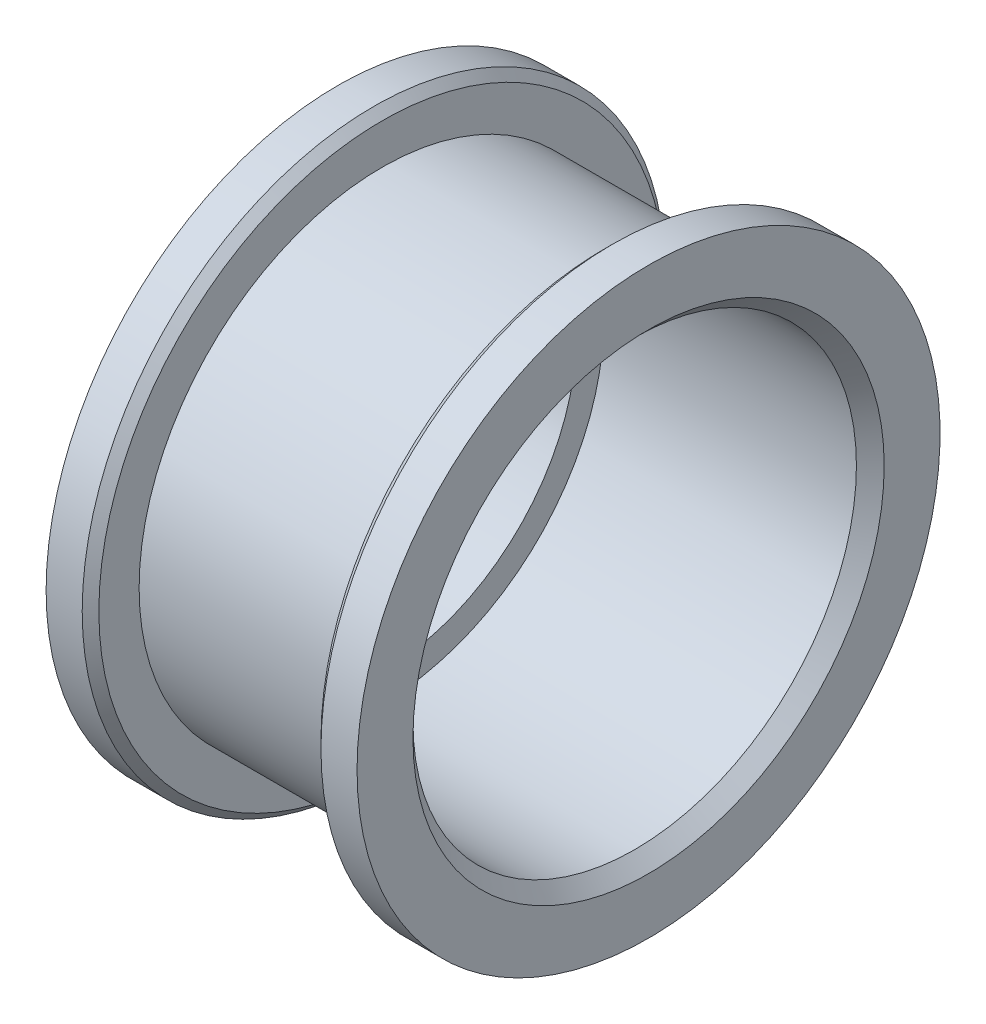
ISO-10303-21;
HEADER;
FILE_DESCRIPTION(('STEP AP214'),'2;1');
FILE_NAME('part.step','',(''),(''),'','','');
FILE_SCHEMA(('AUTOMOTIVE_DESIGN { 1 0 10303 214 1 1 1 1 }'));
ENDSEC;
DATA;
#1=APPLICATION_CONTEXT('core data for automotive mechanical design processes');
#2=APPLICATION_PROTOCOL_DEFINITION('international standard','automotive_design',2000,#1);
#3=PRODUCT_CONTEXT('',#1,'mechanical');
#4=PRODUCT('Part','Part','',(#3));
#5=PRODUCT_RELATED_PRODUCT_CATEGORY('part','',(#4));
#6=PRODUCT_DEFINITION_FORMATION('','',#4);
#7=PRODUCT_DEFINITION_CONTEXT('part definition',#1,'design');
#8=PRODUCT_DEFINITION('design','',#6,#7);
#9=PRODUCT_DEFINITION_SHAPE('','',#8);
#10=(LENGTH_UNIT() NAMED_UNIT(*) SI_UNIT(.MILLI.,.METRE.));
#11=(NAMED_UNIT(*) PLANE_ANGLE_UNIT() SI_UNIT($,.RADIAN.));
#12=(NAMED_UNIT(*) SI_UNIT($,.STERADIAN.) SOLID_ANGLE_UNIT());
#13=UNCERTAINTY_MEASURE_WITH_UNIT(LENGTH_MEASURE(1.E-05),#10,'distance_accuracy_value','');
#14=(GEOMETRIC_REPRESENTATION_CONTEXT(3) GLOBAL_UNCERTAINTY_ASSIGNED_CONTEXT((#13)) GLOBAL_UNIT_ASSIGNED_CONTEXT((#10,
#11,#12)) REPRESENTATION_CONTEXT('',''));
#15=CARTESIAN_POINT('',(0.,0.,0.));
#16=DIRECTION('',(0.,0.,1.));
#17=DIRECTION('',(1.,0.,0.));
#18=AXIS2_PLACEMENT_3D('',#15,#16,#17);
#19=CARTESIAN_POINT('',(6.16,0.,0.));
#20=DIRECTION('',(-1.,0.,0.));
#21=DIRECTION('',(0.,0.,1.));
#22=AXIS2_PLACEMENT_3D('',#19,#20,#21);
#23=CYLINDRICAL_SURFACE('',#22,8.75);
#24=CARTESIAN_POINT('',(4.,0.,0.));
#25=DIRECTION('',(-1.,0.,0.));
#26=DIRECTION('',(0.,0.,1.));
#27=AXIS2_PLACEMENT_3D('',#24,#25,#26);
#28=CIRCLE('',#27,8.75);
#29=CARTESIAN_POINT('',(4.,0.,8.75));
#30=VERTEX_POINT('',#29);
#31=EDGE_CURVE('E64',#30,#30,#28,.F.);
#32=ORIENTED_EDGE('',*,*,#31,.F.);
#33=EDGE_LOOP('',(#32));
#34=FACE_BOUND('',#33,.T.);
#35=CARTESIAN_POINT('',(-4.,0.,0.));
#36=DIRECTION('',(-1.,0.,0.));
#37=DIRECTION('',(0.,0.,1.));
#38=AXIS2_PLACEMENT_3D('',#35,#36,#37);
#39=CIRCLE('',#38,8.75);
#40=CARTESIAN_POINT('',(-4.,0.,8.75));
#41=VERTEX_POINT('',#40);
#42=EDGE_CURVE('E18',#41,#41,#39,.F.);
#43=ORIENTED_EDGE('',*,*,#42,.T.);
#44=EDGE_LOOP('',(#43));
#45=FACE_BOUND('',#44,.T.);
#46=ADVANCED_FACE('F15',(#34,#45),#23,.T.);
#47=CARTESIAN_POINT('',(-4.,0.,0.));
#48=DIRECTION('',(-1.,0.,0.));
#49=DIRECTION('',(0.,0.,1.));
#50=AXIS2_PLACEMENT_3D('',#47,#48,#49);
#51=PLANE('',#50);
#52=ORIENTED_EDGE('',*,*,#42,.F.);
#53=EDGE_LOOP('',(#52));
#54=FACE_BOUND('',#53,.T.);
#55=CARTESIAN_POINT('',(-3.99999999999998,0.,0.));
#56=DIRECTION('',(-1.,0.,0.));
#57=DIRECTION('',(0.,0.,1.));
#58=AXIS2_PLACEMENT_3D('',#55,#56,#57);
#59=CIRCLE('',#58,10.2);
#60=CARTESIAN_POINT('',(-3.99999999999998,0.,10.2));
#61=VERTEX_POINT('',#60);
#62=EDGE_CURVE('E61',#61,#61,#59,.T.);
#63=ORIENTED_EDGE('',*,*,#62,.F.);
#64=EDGE_LOOP('',(#63));
#65=FACE_BOUND('',#64,.T.);
#66=ADVANCED_FACE('F73',(#54,#65),#51,.F.);
#67=CARTESIAN_POINT('',(4.,0.,0.));
#68=DIRECTION('',(-1.,0.,0.));
#69=DIRECTION('',(0.,0.,1.));
#70=AXIS2_PLACEMENT_3D('',#67,#68,#69);
#71=PLANE('',#70);
#72=ORIENTED_EDGE('',*,*,#31,.T.);
#73=EDGE_LOOP('',(#72));
#74=FACE_BOUND('',#73,.T.);
#75=CARTESIAN_POINT('',(4.00000000000197,0.,0.));
#76=DIRECTION('',(1.,0.,0.));
#77=DIRECTION('',(0.,0.,-1.));
#78=AXIS2_PLACEMENT_3D('',#75,#76,#77);
#79=CIRCLE('',#78,10.199999999998);
#80=CARTESIAN_POINT('',(4.00000000000197,0.,-10.199999999998));
#81=VERTEX_POINT('',#80);
#82=EDGE_CURVE('E57',#81,#81,#79,.T.);
#83=ORIENTED_EDGE('',*,*,#82,.F.);
#84=EDGE_LOOP('',(#83));
#85=FACE_BOUND('',#84,.T.);
#86=ADVANCED_FACE('F76',(#74,#85),#71,.T.);
#87=CARTESIAN_POINT('',(-4.30000000000002,0.,0.));
#88=DIRECTION('',(-1.,0.,0.));
#89=DIRECTION('',(0.,0.,1.));
#90=AXIS2_PLACEMENT_3D('',#87,#88,#89);
#91=CONICAL_SURFACE('',#90,10.5,0.785398163397298);
#92=ORIENTED_EDGE('',*,*,#62,.T.);
#93=EDGE_LOOP('',(#92));
#94=FACE_BOUND('',#93,.T.);
#95=CARTESIAN_POINT('',(-4.3,0.,0.));
#96=DIRECTION('',(-1.,0.,0.));
#97=DIRECTION('',(0.,0.,1.));
#98=AXIS2_PLACEMENT_3D('',#95,#96,#97);
#99=CIRCLE('',#98,10.5);
#100=CARTESIAN_POINT('',(-4.3,0.,10.5));
#101=VERTEX_POINT('',#100);
#102=EDGE_CURVE('E36',#101,#101,#99,.T.);
#103=ORIENTED_EDGE('',*,*,#102,.F.);
#104=EDGE_LOOP('',(#103));
#105=FACE_BOUND('',#104,.T.);
#106=ADVANCED_FACE('F79',(#94,#105),#91,.T.);
#107=CARTESIAN_POINT('',(4.30000000000203,0.,0.));
#108=DIRECTION('',(1.,0.,0.));
#109=DIRECTION('',(0.,0.,-1.));
#110=AXIS2_PLACEMENT_3D('',#107,#108,#109);
#111=CONICAL_SURFACE('',#110,10.499999999998,0.785398163397299);
#112=CARTESIAN_POINT('',(4.3,0.,0.));
#113=DIRECTION('',(-1.,0.,0.));
#114=DIRECTION('',(0.,0.,1.));
#115=AXIS2_PLACEMENT_3D('',#112,#113,#114);
#116=CIRCLE('',#115,10.5);
#117=CARTESIAN_POINT('',(4.3,0.,10.5));
#118=VERTEX_POINT('',#117);
#119=EDGE_CURVE('E56',#118,#118,#116,.F.);
#120=ORIENTED_EDGE('',*,*,#119,.F.);
#121=EDGE_LOOP('',(#120));
#122=FACE_BOUND('',#121,.T.);
#123=ORIENTED_EDGE('',*,*,#82,.T.);
#124=EDGE_LOOP('',(#123));
#125=FACE_BOUND('',#124,.T.);
#126=ADVANCED_FACE('F82',(#122,#125),#111,.T.);
#127=CARTESIAN_POINT('',(6.16,0.,0.));
#128=DIRECTION('',(-1.,0.,0.));
#129=DIRECTION('',(0.,0.,1.));
#130=AXIS2_PLACEMENT_3D('',#127,#128,#129);
#131=CYLINDRICAL_SURFACE('',#130,10.5);
#132=CARTESIAN_POINT('',(-5.6,0.,0.));
#133=DIRECTION('',(-1.,0.,0.));
#134=DIRECTION('',(0.,0.,1.));
#135=AXIS2_PLACEMENT_3D('',#132,#133,#134);
#136=CIRCLE('',#135,10.5);
#137=CARTESIAN_POINT('',(-5.6,0.,10.5));
#138=VERTEX_POINT('',#137);
#139=EDGE_CURVE('E52',#138,#138,#136,.T.);
#140=ORIENTED_EDGE('',*,*,#139,.F.);
#141=EDGE_LOOP('',(#140));
#142=FACE_BOUND('',#141,.T.);
#143=ORIENTED_EDGE('',*,*,#102,.T.);
#144=EDGE_LOOP('',(#143));
#145=FACE_BOUND('',#144,.T.);
#146=ADVANCED_FACE('F96',(#142,#145),#131,.T.);
#147=CARTESIAN_POINT('',(6.16,0.,0.));
#148=DIRECTION('',(-1.,0.,0.));
#149=DIRECTION('',(0.,0.,1.));
#150=AXIS2_PLACEMENT_3D('',#147,#148,#149);
#151=CYLINDRICAL_SURFACE('',#150,10.5);
#152=CARTESIAN_POINT('',(5.6,0.,0.));
#153=DIRECTION('',(-1.,0.,0.));
#154=DIRECTION('',(0.,0.,1.));
#155=AXIS2_PLACEMENT_3D('',#152,#153,#154);
#156=CIRCLE('',#155,10.5);
#157=CARTESIAN_POINT('',(5.6,0.,10.5));
#158=VERTEX_POINT('',#157);
#159=EDGE_CURVE('E48',#158,#158,#156,.T.);
#160=ORIENTED_EDGE('',*,*,#159,.T.);
#161=EDGE_LOOP('',(#160));
#162=FACE_BOUND('',#161,.T.);
#163=ORIENTED_EDGE('',*,*,#119,.T.);
#164=EDGE_LOOP('',(#163));
#165=FACE_BOUND('',#164,.T.);
#166=ADVANCED_FACE('F92',(#162,#165),#151,.T.);
#167=CARTESIAN_POINT('',(-5.6,0.,0.));
#168=DIRECTION('',(-1.,0.,0.));
#169=DIRECTION('',(0.,0.,1.));
#170=AXIS2_PLACEMENT_3D('',#167,#168,#169);
#171=PLANE('',#170);
#172=CARTESIAN_POINT('',(-5.6,0.,0.));
#173=DIRECTION('',(-1.,0.,0.));
#174=DIRECTION('',(0.,0.,1.));
#175=AXIS2_PLACEMENT_3D('',#172,#173,#174);
#176=CIRCLE('',#175,7.);
#177=CARTESIAN_POINT('',(-5.6,0.,7.));
#178=VERTEX_POINT('',#177);
#179=EDGE_CURVE('E44',#178,#178,#176,.F.);
#180=ORIENTED_EDGE('',*,*,#179,.T.);
#181=EDGE_LOOP('',(#180));
#182=FACE_BOUND('',#181,.T.);
#183=ORIENTED_EDGE('',*,*,#139,.T.);
#184=EDGE_LOOP('',(#183));
#185=FACE_BOUND('',#184,.T.);
#186=ADVANCED_FACE('F131',(#182,#185),#171,.T.);
#187=CARTESIAN_POINT('',(5.6,0.,0.));
#188=DIRECTION('',(-1.,0.,0.));
#189=DIRECTION('',(0.,0.,1.));
#190=AXIS2_PLACEMENT_3D('',#187,#188,#189);
#191=PLANE('',#190);
#192=CARTESIAN_POINT('',(5.60000000000004,0.,0.));
#193=DIRECTION('',(1.,0.,0.));
#194=DIRECTION('',(0.,0.,-1.));
#195=AXIS2_PLACEMENT_3D('',#192,#193,#194);
#196=CIRCLE('',#195,8.48714999999996);
#197=CARTESIAN_POINT('',(5.60000000000004,0.,-8.48714999999996));
#198=VERTEX_POINT('',#197);
#199=EDGE_CURVE('E40',#198,#198,#196,.F.);
#200=ORIENTED_EDGE('',*,*,#199,.T.);
#201=EDGE_LOOP('',(#200));
#202=FACE_BOUND('',#201,.T.);
#203=ORIENTED_EDGE('',*,*,#159,.F.);
#204=EDGE_LOOP('',(#203));
#205=FACE_BOUND('',#204,.T.);
#206=ADVANCED_FACE('F127',(#202,#205),#191,.F.);
#207=CARTESIAN_POINT('',(6.16,0.,0.));
#208=DIRECTION('',(-1.,0.,0.));
#209=DIRECTION('',(0.,0.,1.));
#210=AXIS2_PLACEMENT_3D('',#207,#208,#209);
#211=CYLINDRICAL_SURFACE('',#210,7.);
#212=CARTESIAN_POINT('',(-4.,0.,0.));
#213=DIRECTION('',(-1.,0.,0.));
#214=DIRECTION('',(0.,0.,1.));
#215=AXIS2_PLACEMENT_3D('',#212,#213,#214);
#216=CIRCLE('',#215,7.);
#217=CARTESIAN_POINT('',(-4.,0.,7.));
#218=VERTEX_POINT('',#217);
#219=EDGE_CURVE('E32',#218,#218,#216,.F.);
#220=ORIENTED_EDGE('',*,*,#219,.T.);
#221=EDGE_LOOP('',(#220));
#222=FACE_BOUND('',#221,.T.);
#223=ORIENTED_EDGE('',*,*,#179,.F.);
#224=EDGE_LOOP('',(#223));
#225=FACE_BOUND('',#224,.T.);
#226=ADVANCED_FACE('F123',(#222,#225),#211,.F.);
#227=CARTESIAN_POINT('',(5.60000000000004,0.,0.));
#228=DIRECTION('',(1.,0.,0.));
#229=DIRECTION('',(0.,0.,-1.));
#230=AXIS2_PLACEMENT_3D('',#227,#228,#229);
#231=CONICAL_SURFACE('',#230,8.48714999999996,0.785398163397299);
#232=CARTESIAN_POINT('',(5.1,0.,0.));
#233=DIRECTION('',(-1.,0.,0.));
#234=DIRECTION('',(0.,0.,1.));
#235=AXIS2_PLACEMENT_3D('',#232,#233,#234);
#236=CIRCLE('',#235,7.98715);
#237=CARTESIAN_POINT('',(5.1,0.,7.98715));
#238=VERTEX_POINT('',#237);
#239=EDGE_CURVE('E23',#238,#238,#236,.T.);
#240=ORIENTED_EDGE('',*,*,#239,.T.);
#241=EDGE_LOOP('',(#240));
#242=FACE_BOUND('',#241,.T.);
#243=ORIENTED_EDGE('',*,*,#199,.F.);
#244=EDGE_LOOP('',(#243));
#245=FACE_BOUND('',#244,.T.);
#246=ADVANCED_FACE('F116',(#242,#245),#231,.F.);
#247=CARTESIAN_POINT('',(-4.,0.,0.));
#248=DIRECTION('',(-1.,0.,0.));
#249=DIRECTION('',(0.,0.,1.));
#250=AXIS2_PLACEMENT_3D('',#247,#248,#249);
#251=PLANE('',#250);
#252=ORIENTED_EDGE('',*,*,#219,.F.);
#253=EDGE_LOOP('',(#252));
#254=FACE_BOUND('',#253,.T.);
#255=CARTESIAN_POINT('',(-4.,0.,0.));
#256=DIRECTION('',(-1.,0.,0.));
#257=DIRECTION('',(0.,0.,1.));
#258=AXIS2_PLACEMENT_3D('',#255,#256,#257);
#259=CIRCLE('',#258,7.98715);
#260=CARTESIAN_POINT('',(-4.,0.,7.98715));
#261=VERTEX_POINT('',#260);
#262=EDGE_CURVE('E10',#261,#261,#259,.F.);
#263=ORIENTED_EDGE('',*,*,#262,.T.);
#264=EDGE_LOOP('',(#263));
#265=FACE_BOUND('',#264,.T.);
#266=ADVANCED_FACE('F108',(#254,#265),#251,.F.);
#267=CARTESIAN_POINT('',(6.16,0.,0.));
#268=DIRECTION('',(-1.,0.,0.));
#269=DIRECTION('',(0.,0.,1.));
#270=AXIS2_PLACEMENT_3D('',#267,#268,#269);
#271=CYLINDRICAL_SURFACE('',#270,7.98715);
#272=ORIENTED_EDGE('',*,*,#262,.F.);
#273=EDGE_LOOP('',(#272));
#274=FACE_BOUND('',#273,.T.);
#275=ORIENTED_EDGE('',*,*,#239,.F.);
#276=EDGE_LOOP('',(#275));
#277=FACE_BOUND('',#276,.T.);
#278=ADVANCED_FACE('F106',(#274,#277),#271,.F.);
#279=CLOSED_SHELL('',(#46,#66,#86,#106,#126,#146,#166,#186,#206,#226,#246,#266,#278));
#280=MANIFOLD_SOLID_BREP('B1',#279);
#281=ADVANCED_BREP_SHAPE_REPRESENTATION('',(#18,#280),#14);
#282=SHAPE_DEFINITION_REPRESENTATION(#9,#281);
ENDSEC;
END-ISO-10303-21;
